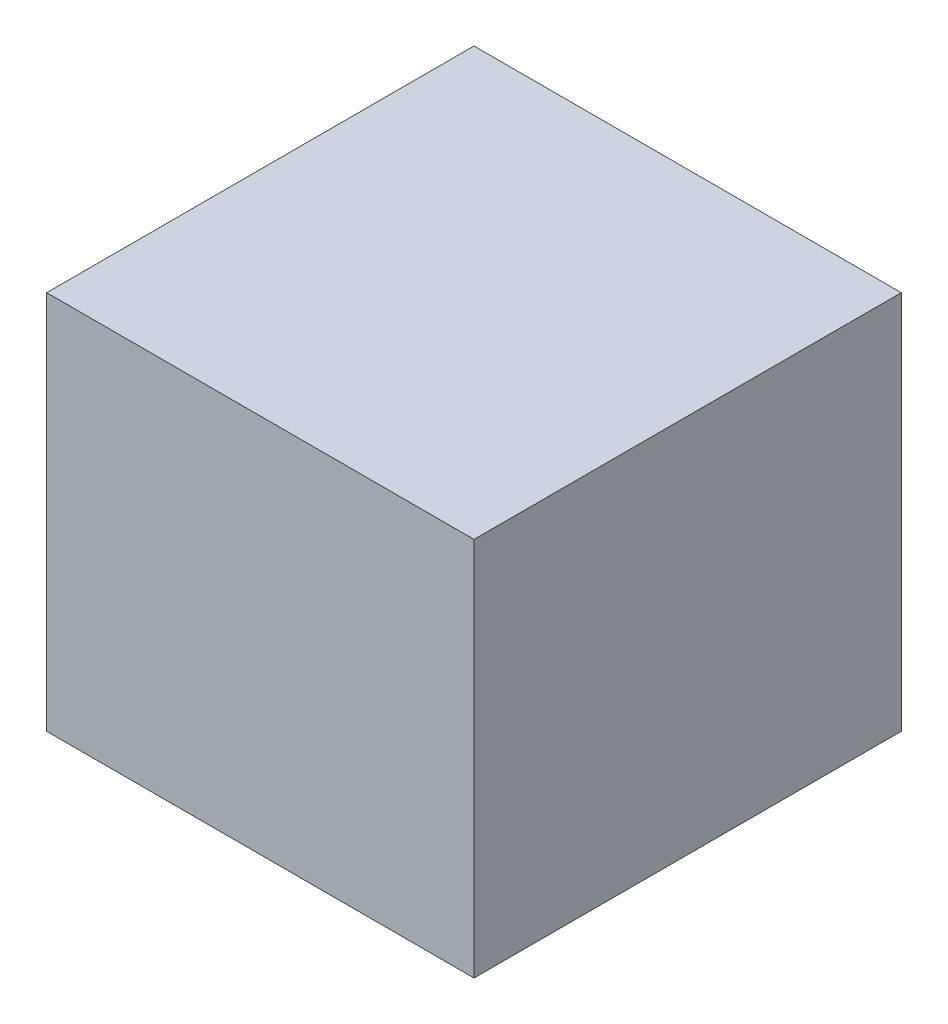
ISO-10303-21;
HEADER;
FILE_DESCRIPTION(('STEP AP214'),'2;1');
FILE_NAME('part.step','',(''),(''),'','','');
FILE_SCHEMA(('AUTOMOTIVE_DESIGN { 1 0 10303 214 1 1 1 1 }'));
ENDSEC;
DATA;
#1=APPLICATION_CONTEXT('core data for automotive mechanical design processes');
#2=APPLICATION_PROTOCOL_DEFINITION('international standard','automotive_design',2000,#1);
#3=PRODUCT_CONTEXT('',#1,'mechanical');
#4=PRODUCT('Part','Part','',(#3));
#5=PRODUCT_RELATED_PRODUCT_CATEGORY('part','',(#4));
#6=PRODUCT_DEFINITION_FORMATION('','',#4);
#7=PRODUCT_DEFINITION_CONTEXT('part definition',#1,'design');
#8=PRODUCT_DEFINITION('design','',#6,#7);
#9=PRODUCT_DEFINITION_SHAPE('','',#8);
#10=(LENGTH_UNIT() NAMED_UNIT(*) SI_UNIT(.MILLI.,.METRE.));
#11=(NAMED_UNIT(*) PLANE_ANGLE_UNIT() SI_UNIT($,.RADIAN.));
#12=(NAMED_UNIT(*) SI_UNIT($,.STERADIAN.) SOLID_ANGLE_UNIT());
#13=UNCERTAINTY_MEASURE_WITH_UNIT(LENGTH_MEASURE(1.E-05),#10,'distance_accuracy_value','');
#14=(GEOMETRIC_REPRESENTATION_CONTEXT(3) GLOBAL_UNCERTAINTY_ASSIGNED_CONTEXT((#13)) GLOBAL_UNIT_ASSIGNED_CONTEXT((#10,
#11,#12)) REPRESENTATION_CONTEXT('',''));
#15=CARTESIAN_POINT('',(0.,0.,0.));
#16=DIRECTION('',(0.,0.,1.));
#17=DIRECTION('',(1.,0.,0.));
#18=AXIS2_PLACEMENT_3D('',#15,#16,#17);
#19=CARTESIAN_POINT('',(-0.67499992,-0.5999988,0.));
#20=DIRECTION('',(0.,1.,0.));
#21=DIRECTION('',(1.,0.,0.));
#22=AXIS2_PLACEMENT_3D('',#19,#20,#21);
#23=PLANE('',#22);
#24=DIRECTION('',(1.,0.,0.));
#25=VECTOR('',#24,1.);
#26=CARTESIAN_POINT('',(-0.67499992,-0.5999988,0.));
#27=LINE('',#26,#25);
#28=CARTESIAN_POINT('',(-0.67499992,-0.5999988,0.));
#29=VERTEX_POINT('',#28);
#30=CARTESIAN_POINT('',(0.67499992,-0.5999988,0.));
#31=VERTEX_POINT('',#30);
#32=EDGE_CURVE('E11',#29,#31,#27,.T.);
#33=ORIENTED_EDGE('',*,*,#32,.T.);
#34=DIRECTION('',(0.,0.,1.));
#35=VECTOR('',#34,1.);
#36=CARTESIAN_POINT('',(0.67499992,-0.5999988,0.));
#37=LINE('',#36,#35);
#38=CARTESIAN_POINT('',(0.67499992,-0.5999988,1.34999984));
#39=VERTEX_POINT('',#38);
#40=EDGE_CURVE('E27',#31,#39,#37,.T.);
#41=ORIENTED_EDGE('',*,*,#40,.T.);
#42=DIRECTION('',(1.,0.,0.));
#43=VECTOR('',#42,1.);
#44=CARTESIAN_POINT('',(-0.67499992,-0.5999988,1.34999984));
#45=LINE('',#44,#43);
#46=CARTESIAN_POINT('',(-0.67499992,-0.5999988,1.34999984));
#47=VERTEX_POINT('',#46);
#48=EDGE_CURVE('E89',#47,#39,#45,.T.);
#49=ORIENTED_EDGE('',*,*,#48,.F.);
#50=DIRECTION('',(0.,0.,1.));
#51=VECTOR('',#50,1.);
#52=CARTESIAN_POINT('',(-0.67499992,-0.5999988,0.));
#53=LINE('',#52,#51);
#54=EDGE_CURVE('E86',#29,#47,#53,.T.);
#55=ORIENTED_EDGE('',*,*,#54,.F.);
#56=EDGE_LOOP('',(#33,#41,#49,#55));
#57=FACE_BOUND('',#56,.T.);
#58=ADVANCED_FACE('F16',(#57),#23,.F.);
#59=CARTESIAN_POINT('',(0.67499992,-0.5999988,0.));
#60=DIRECTION('',(-1.,0.,0.));
#61=DIRECTION('',(0.,0.,1.));
#62=AXIS2_PLACEMENT_3D('',#59,#60,#61);
#63=PLANE('',#62);
#64=DIRECTION('',(0.,1.,0.));
#65=VECTOR('',#64,1.);
#66=CARTESIAN_POINT('',(0.67499992,-0.5999988,0.));
#67=LINE('',#66,#65);
#68=CARTESIAN_POINT('',(0.67499992,0.60000134,0.));
#69=VERTEX_POINT('',#68);
#70=EDGE_CURVE('E20',#31,#69,#67,.T.);
#71=ORIENTED_EDGE('',*,*,#70,.T.);
#72=DIRECTION('',(0.,0.,1.));
#73=VECTOR('',#72,1.);
#74=CARTESIAN_POINT('',(0.67499992,0.60000134,0.));
#75=LINE('',#74,#73);
#76=CARTESIAN_POINT('',(0.67499992,0.60000134,1.34999984));
#77=VERTEX_POINT('',#76);
#78=EDGE_CURVE('E81',#69,#77,#75,.T.);
#79=ORIENTED_EDGE('',*,*,#78,.T.);
#80=DIRECTION('',(0.,1.,0.));
#81=VECTOR('',#80,1.);
#82=CARTESIAN_POINT('',(0.67499992,-0.5999988,1.34999984));
#83=LINE('',#82,#81);
#84=EDGE_CURVE('E76',#39,#77,#83,.T.);
#85=ORIENTED_EDGE('',*,*,#84,.F.);
#86=ORIENTED_EDGE('',*,*,#40,.F.);
#87=EDGE_LOOP('',(#71,#79,#85,#86));
#88=FACE_BOUND('',#87,.T.);
#89=ADVANCED_FACE('F153',(#88),#63,.F.);
#90=CARTESIAN_POINT('',(0.67499992,0.60000134,0.));
#91=DIRECTION('',(0.,-1.,0.));
#92=DIRECTION('',(0.,0.,-1.));
#93=AXIS2_PLACEMENT_3D('',#90,#91,#92);
#94=PLANE('',#93);
#95=DIRECTION('',(-1.,0.,0.));
#96=VECTOR('',#95,1.);
#97=CARTESIAN_POINT('',(0.67499992,0.60000134,0.));
#98=LINE('',#97,#96);
#99=CARTESIAN_POINT('',(-0.67499992,0.60000134,0.));
#100=VERTEX_POINT('',#99);
#101=EDGE_CURVE('E104',#69,#100,#98,.T.);
#102=ORIENTED_EDGE('',*,*,#101,.T.);
#103=DIRECTION('',(0.,0.,1.));
#104=VECTOR('',#103,1.);
#105=CARTESIAN_POINT('',(-0.67499992,0.60000134,0.));
#106=LINE('',#105,#104);
#107=CARTESIAN_POINT('',(-0.67499992,0.60000134,1.34999984));
#108=VERTEX_POINT('',#107);
#109=EDGE_CURVE('E68',#100,#108,#106,.T.);
#110=ORIENTED_EDGE('',*,*,#109,.T.);
#111=DIRECTION('',(-1.,0.,0.));
#112=VECTOR('',#111,1.);
#113=CARTESIAN_POINT('',(0.67499992,0.60000134,1.34999984));
#114=LINE('',#113,#112);
#115=EDGE_CURVE('E59',#77,#108,#114,.T.);
#116=ORIENTED_EDGE('',*,*,#115,.F.);
#117=ORIENTED_EDGE('',*,*,#78,.F.);
#118=EDGE_LOOP('',(#102,#110,#116,#117));
#119=FACE_BOUND('',#118,.T.);
#120=ADVANCED_FACE('F154',(#119),#94,.F.);
#121=CARTESIAN_POINT('',(-0.67499992,0.60000134,0.));
#122=DIRECTION('',(1.,0.,0.));
#123=DIRECTION('',(0.,1.,0.));
#124=AXIS2_PLACEMENT_3D('',#121,#122,#123);
#125=PLANE('',#124);
#126=DIRECTION('',(0.,-1.,0.));
#127=VECTOR('',#126,1.);
#128=CARTESIAN_POINT('',(-0.67499992,0.60000134,0.));
#129=LINE('',#128,#127);
#130=EDGE_CURVE('E91',#100,#29,#129,.T.);
#131=ORIENTED_EDGE('',*,*,#130,.T.);
#132=ORIENTED_EDGE('',*,*,#54,.T.);
#133=DIRECTION('',(0.,-1.,0.));
#134=VECTOR('',#133,1.);
#135=CARTESIAN_POINT('',(-0.67499992,0.60000134,1.34999984));
#136=LINE('',#135,#134);
#137=EDGE_CURVE('E110',#108,#47,#136,.T.);
#138=ORIENTED_EDGE('',*,*,#137,.F.);
#139=ORIENTED_EDGE('',*,*,#109,.F.);
#140=EDGE_LOOP('',(#131,#132,#138,#139));
#141=FACE_BOUND('',#140,.T.);
#142=ADVANCED_FACE('F97',(#141),#125,.F.);
#143=CARTESIAN_POINT('',(-0.67499992,-0.5999988,0.));
#144=DIRECTION('',(0.,0.,-1.));
#145=DIRECTION('',(0.,-1.,0.));
#146=AXIS2_PLACEMENT_3D('',#143,#144,#145);
#147=PLANE('',#146);
#148=ORIENTED_EDGE('',*,*,#130,.F.);
#149=ORIENTED_EDGE('',*,*,#101,.F.);
#150=ORIENTED_EDGE('',*,*,#70,.F.);
#151=ORIENTED_EDGE('',*,*,#32,.F.);
#152=EDGE_LOOP('',(#148,#149,#150,#151));
#153=FACE_BOUND('',#152,.T.);
#154=ADVANCED_FACE('F95',(#153),#147,.T.);
#155=CARTESIAN_POINT('',(-0.67499992,-0.5999988,1.34999984));
#156=DIRECTION('',(0.,0.,-1.));
#157=DIRECTION('',(0.,-1.,0.));
#158=AXIS2_PLACEMENT_3D('',#155,#156,#157);
#159=PLANE('',#158);
#160=ORIENTED_EDGE('',*,*,#48,.T.);
#161=ORIENTED_EDGE('',*,*,#84,.T.);
#162=ORIENTED_EDGE('',*,*,#115,.T.);
#163=ORIENTED_EDGE('',*,*,#137,.T.);
#164=EDGE_LOOP('',(#160,#161,#162,#163));
#165=FACE_BOUND('',#164,.T.);
#166=ADVANCED_FACE('F18',(#165),#159,.F.);
#167=CLOSED_SHELL('',(#58,#89,#120,#142,#154,#166));
#168=MANIFOLD_SOLID_BREP('B1',#167);
#169=ADVANCED_BREP_SHAPE_REPRESENTATION('',(#18,#168),#14);
#170=SHAPE_DEFINITION_REPRESENTATION(#9,#169);
ENDSEC;
END-ISO-10303-21;
